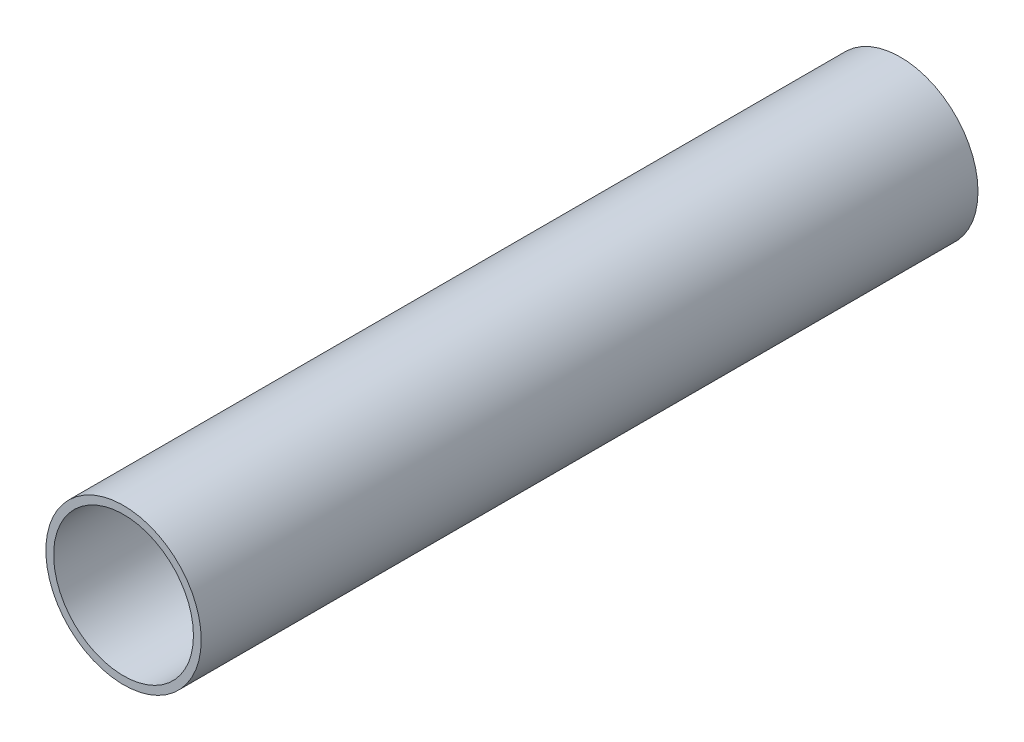
ISO-10303-21;
HEADER;
FILE_DESCRIPTION(('STEP AP214'),'2;1');
FILE_NAME('part.step','',(''),(''),'','','');
FILE_SCHEMA(('AUTOMOTIVE_DESIGN { 1 0 10303 214 1 1 1 1 }'));
ENDSEC;
DATA;
#1=APPLICATION_CONTEXT('core data for automotive mechanical design processes');
#2=APPLICATION_PROTOCOL_DEFINITION('international standard','automotive_design',2000,#1);
#3=PRODUCT_CONTEXT('',#1,'mechanical');
#4=PRODUCT('Part','Part','',(#3));
#5=PRODUCT_RELATED_PRODUCT_CATEGORY('part','',(#4));
#6=PRODUCT_DEFINITION_FORMATION('','',#4);
#7=PRODUCT_DEFINITION_CONTEXT('part definition',#1,'design');
#8=PRODUCT_DEFINITION('design','',#6,#7);
#9=PRODUCT_DEFINITION_SHAPE('','',#8);
#10=(LENGTH_UNIT() NAMED_UNIT(*) SI_UNIT(.MILLI.,.METRE.));
#11=(NAMED_UNIT(*) PLANE_ANGLE_UNIT() SI_UNIT($,.RADIAN.));
#12=(NAMED_UNIT(*) SI_UNIT($,.STERADIAN.) SOLID_ANGLE_UNIT());
#13=UNCERTAINTY_MEASURE_WITH_UNIT(LENGTH_MEASURE(1.E-05),#10,'distance_accuracy_value','');
#14=(GEOMETRIC_REPRESENTATION_CONTEXT(3) GLOBAL_UNCERTAINTY_ASSIGNED_CONTEXT((#13)) GLOBAL_UNIT_ASSIGNED_CONTEXT((#10,
#11,#12)) REPRESENTATION_CONTEXT('',''));
#15=CARTESIAN_POINT('',(0.,0.,0.));
#16=DIRECTION('',(0.,0.,1.));
#17=DIRECTION('',(1.,0.,0.));
#18=AXIS2_PLACEMENT_3D('',#15,#16,#17);
#19=CARTESIAN_POINT('',(0.,0.,40.));
#20=DIRECTION('',(0.,0.,1.));
#21=DIRECTION('',(1.,0.,0.));
#22=AXIS2_PLACEMENT_3D('',#19,#20,#21);
#23=PLANE('',#22);
#24=CARTESIAN_POINT('',(0.,0.,40.));
#25=DIRECTION('',(0.,0.,1.));
#26=DIRECTION('',(1.,0.,0.));
#27=AXIS2_PLACEMENT_3D('',#24,#25,#26);
#28=CIRCLE('',#27,8.);
#29=CARTESIAN_POINT('',(8.,0.,40.));
#30=VERTEX_POINT('',#29);
#31=EDGE_CURVE('E9',#30,#30,#28,.T.);
#32=ORIENTED_EDGE('',*,*,#31,.T.);
#33=EDGE_LOOP('',(#32));
#34=FACE_BOUND('',#33,.T.);
#35=CARTESIAN_POINT('',(0.,0.,40.));
#36=DIRECTION('',(0.,0.,1.));
#37=DIRECTION('',(1.,0.,0.));
#38=AXIS2_PLACEMENT_3D('',#35,#36,#37);
#39=CIRCLE('',#38,7.2);
#40=CARTESIAN_POINT('',(7.2,0.,40.));
#41=VERTEX_POINT('',#40);
#42=EDGE_CURVE('E34',#41,#41,#39,.T.);
#43=ORIENTED_EDGE('',*,*,#42,.F.);
#44=EDGE_LOOP('',(#43));
#45=FACE_BOUND('',#44,.T.);
#46=ADVANCED_FACE('F14',(#34,#45),#23,.T.);
#47=CARTESIAN_POINT('',(0.,0.,-40.));
#48=DIRECTION('',(0.,0.,1.));
#49=DIRECTION('',(1.,0.,0.));
#50=AXIS2_PLACEMENT_3D('',#47,#48,#49);
#51=PLANE('',#50);
#52=CARTESIAN_POINT('',(0.,0.,-40.));
#53=DIRECTION('',(0.,0.,1.));
#54=DIRECTION('',(1.,0.,0.));
#55=AXIS2_PLACEMENT_3D('',#52,#53,#54);
#56=CIRCLE('',#55,8.);
#57=CARTESIAN_POINT('',(8.,0.,-40.));
#58=VERTEX_POINT('',#57);
#59=EDGE_CURVE('E18',#58,#58,#56,.T.);
#60=ORIENTED_EDGE('',*,*,#59,.F.);
#61=EDGE_LOOP('',(#60));
#62=FACE_BOUND('',#61,.T.);
#63=CARTESIAN_POINT('',(0.,0.,-40.));
#64=DIRECTION('',(0.,0.,1.));
#65=DIRECTION('',(1.,0.,0.));
#66=AXIS2_PLACEMENT_3D('',#63,#64,#65);
#67=CIRCLE('',#66,7.2);
#68=CARTESIAN_POINT('',(7.2,0.,-40.));
#69=VERTEX_POINT('',#68);
#70=EDGE_CURVE('E29',#69,#69,#67,.T.);
#71=ORIENTED_EDGE('',*,*,#70,.T.);
#72=EDGE_LOOP('',(#71));
#73=FACE_BOUND('',#72,.T.);
#74=ADVANCED_FACE('F47',(#62,#73),#51,.F.);
#75=CARTESIAN_POINT('',(0.,0.,40.));
#76=DIRECTION('',(0.,0.,-1.));
#77=DIRECTION('',(-1.,0.,0.));
#78=AXIS2_PLACEMENT_3D('',#75,#76,#77);
#79=CYLINDRICAL_SURFACE('',#78,8.);
#80=ORIENTED_EDGE('',*,*,#31,.F.);
#81=EDGE_LOOP('',(#80));
#82=FACE_BOUND('',#81,.T.);
#83=ORIENTED_EDGE('',*,*,#59,.T.);
#84=EDGE_LOOP('',(#83));
#85=FACE_BOUND('',#84,.T.);
#86=ADVANCED_FACE('F16',(#82,#85),#79,.T.);
#87=CARTESIAN_POINT('',(0.,0.,40.));
#88=DIRECTION('',(0.,0.,-1.));
#89=DIRECTION('',(-1.,0.,0.));
#90=AXIS2_PLACEMENT_3D('',#87,#88,#89);
#91=CYLINDRICAL_SURFACE('',#90,7.2);
#92=ORIENTED_EDGE('',*,*,#42,.T.);
#93=EDGE_LOOP('',(#92));
#94=FACE_BOUND('',#93,.T.);
#95=ORIENTED_EDGE('',*,*,#70,.F.);
#96=EDGE_LOOP('',(#95));
#97=FACE_BOUND('',#96,.T.);
#98=ADVANCED_FACE('F43',(#94,#97),#91,.F.);
#99=CLOSED_SHELL('',(#46,#74,#86,#98));
#100=MANIFOLD_SOLID_BREP('B1',#99);
#101=ADVANCED_BREP_SHAPE_REPRESENTATION('',(#18,#100),#14);
#102=SHAPE_DEFINITION_REPRESENTATION(#9,#101);
ENDSEC;
END-ISO-10303-21;
